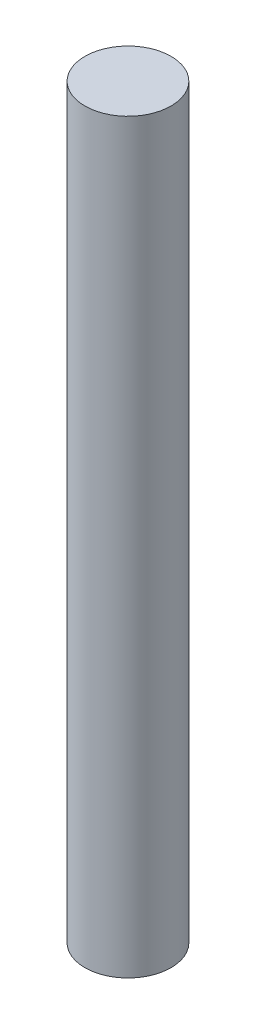
ISO-10303-21;
HEADER;
FILE_DESCRIPTION(('STEP AP214'),'2;1');
FILE_NAME('part.step','',(''),(''),'','','');
FILE_SCHEMA(('AUTOMOTIVE_DESIGN { 1 0 10303 214 1 1 1 1 }'));
ENDSEC;
DATA;
#1=APPLICATION_CONTEXT('core data for automotive mechanical design processes');
#2=APPLICATION_PROTOCOL_DEFINITION('international standard','automotive_design',2000,#1);
#3=PRODUCT_CONTEXT('',#1,'mechanical');
#4=PRODUCT('Part','Part','',(#3));
#5=PRODUCT_RELATED_PRODUCT_CATEGORY('part','',(#4));
#6=PRODUCT_DEFINITION_FORMATION('','',#4);
#7=PRODUCT_DEFINITION_CONTEXT('part definition',#1,'design');
#8=PRODUCT_DEFINITION('design','',#6,#7);
#9=PRODUCT_DEFINITION_SHAPE('','',#8);
#10=(LENGTH_UNIT() NAMED_UNIT(*) SI_UNIT(.MILLI.,.METRE.));
#11=(NAMED_UNIT(*) PLANE_ANGLE_UNIT() SI_UNIT($,.RADIAN.));
#12=(NAMED_UNIT(*) SI_UNIT($,.STERADIAN.) SOLID_ANGLE_UNIT());
#13=UNCERTAINTY_MEASURE_WITH_UNIT(LENGTH_MEASURE(1.E-05),#10,'distance_accuracy_value','');
#14=(GEOMETRIC_REPRESENTATION_CONTEXT(3) GLOBAL_UNCERTAINTY_ASSIGNED_CONTEXT((#13)) GLOBAL_UNIT_ASSIGNED_CONTEXT((#10,
#11,#12)) REPRESENTATION_CONTEXT('',''));
#15=CARTESIAN_POINT('',(0.,0.,0.));
#16=DIRECTION('',(0.,0.,1.));
#17=DIRECTION('',(1.,0.,0.));
#18=AXIS2_PLACEMENT_3D('',#15,#16,#17);
#19=CARTESIAN_POINT('',(0.,13.,0.));
#20=DIRECTION('',(0.,-1.,0.));
#21=DIRECTION('',(0.,0.,-1.));
#22=AXIS2_PLACEMENT_3D('',#19,#20,#21);
#23=CYLINDRICAL_SURFACE('',#22,0.75);
#24=CARTESIAN_POINT('',(0.,13.,0.));
#25=DIRECTION('',(0.,1.,0.));
#26=DIRECTION('',(0.,0.,1.));
#27=AXIS2_PLACEMENT_3D('',#24,#25,#26);
#28=CIRCLE('',#27,0.75);
#29=CARTESIAN_POINT('',(0.,13.,0.75));
#30=VERTEX_POINT('',#29);
#31=EDGE_CURVE('E10',#30,#30,#28,.T.);
#32=ORIENTED_EDGE('',*,*,#31,.F.);
#33=EDGE_LOOP('',(#32));
#34=FACE_BOUND('',#33,.T.);
#35=CARTESIAN_POINT('',(0.,0.,0.));
#36=DIRECTION('',(0.,1.,0.));
#37=DIRECTION('',(0.,0.,1.));
#38=AXIS2_PLACEMENT_3D('',#35,#36,#37);
#39=CIRCLE('',#38,0.75);
#40=CARTESIAN_POINT('',(0.,0.,0.75));
#41=VERTEX_POINT('',#40);
#42=EDGE_CURVE('E33',#41,#41,#39,.T.);
#43=ORIENTED_EDGE('',*,*,#42,.T.);
#44=EDGE_LOOP('',(#43));
#45=FACE_BOUND('',#44,.T.);
#46=ADVANCED_FACE('F30',(#34,#45),#23,.T.);
#47=CARTESIAN_POINT('',(0.,13.,0.));
#48=DIRECTION('',(0.,1.,0.));
#49=DIRECTION('',(0.,0.,1.));
#50=AXIS2_PLACEMENT_3D('',#47,#48,#49);
#51=PLANE('',#50);
#52=ORIENTED_EDGE('',*,*,#31,.T.);
#53=EDGE_LOOP('',(#52));
#54=FACE_BOUND('',#53,.T.);
#55=ADVANCED_FACE('F45',(#54),#51,.T.);
#56=CARTESIAN_POINT('',(0.,0.,0.));
#57=DIRECTION('',(0.,1.,0.));
#58=DIRECTION('',(0.,0.,1.));
#59=AXIS2_PLACEMENT_3D('',#56,#57,#58);
#60=PLANE('',#59);
#61=ORIENTED_EDGE('',*,*,#42,.F.);
#62=EDGE_LOOP('',(#61));
#63=FACE_BOUND('',#62,.T.);
#64=ADVANCED_FACE('F43',(#63),#60,.F.);
#65=CLOSED_SHELL('',(#46,#55,#64));
#66=MANIFOLD_SOLID_BREP('B2',#65);
#67=ADVANCED_BREP_SHAPE_REPRESENTATION('',(#18,#66),#14);
#68=SHAPE_DEFINITION_REPRESENTATION(#9,#67);
ENDSEC;
END-ISO-10303-21;
